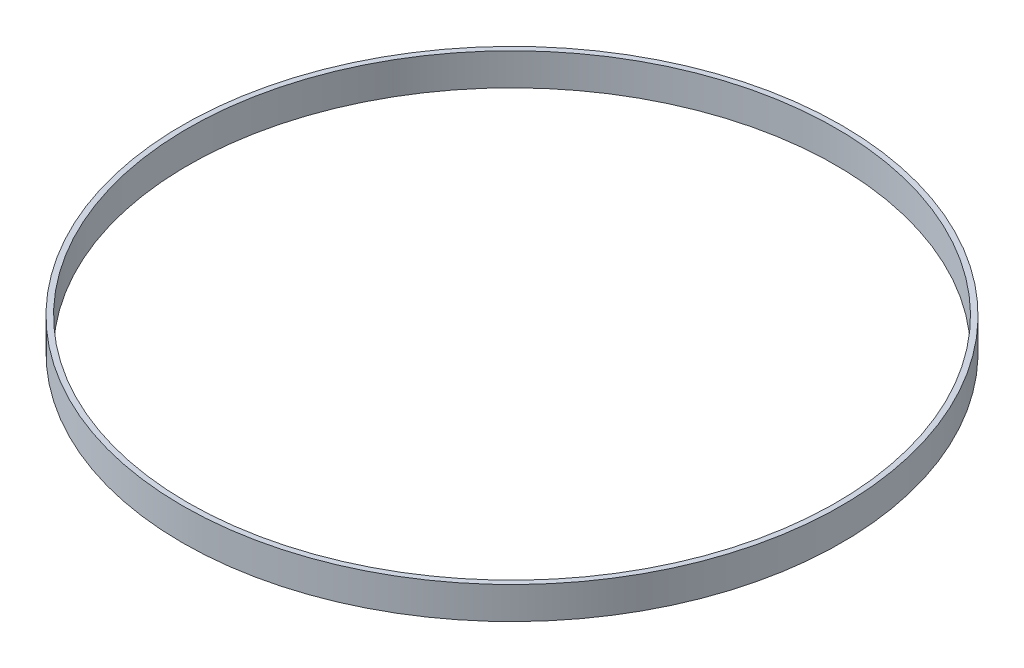
ISO-10303-21;
HEADER;
FILE_DESCRIPTION(('STEP AP214'),'2;1');
FILE_NAME('part.step','',(''),(''),'','','');
FILE_SCHEMA(('AUTOMOTIVE_DESIGN { 1 0 10303 214 1 1 1 1 }'));
ENDSEC;
DATA;
#1=APPLICATION_CONTEXT('core data for automotive mechanical design processes');
#2=APPLICATION_PROTOCOL_DEFINITION('international standard','automotive_design',2000,#1);
#3=PRODUCT_CONTEXT('',#1,'mechanical');
#4=PRODUCT('Part','Part','',(#3));
#5=PRODUCT_RELATED_PRODUCT_CATEGORY('part','',(#4));
#6=PRODUCT_DEFINITION_FORMATION('','',#4);
#7=PRODUCT_DEFINITION_CONTEXT('part definition',#1,'design');
#8=PRODUCT_DEFINITION('design','',#6,#7);
#9=PRODUCT_DEFINITION_SHAPE('','',#8);
#10=(LENGTH_UNIT() NAMED_UNIT(*) SI_UNIT(.MILLI.,.METRE.));
#11=(NAMED_UNIT(*) PLANE_ANGLE_UNIT() SI_UNIT($,.RADIAN.));
#12=(NAMED_UNIT(*) SI_UNIT($,.STERADIAN.) SOLID_ANGLE_UNIT());
#13=UNCERTAINTY_MEASURE_WITH_UNIT(LENGTH_MEASURE(1.E-05),#10,'distance_accuracy_value','');
#14=(GEOMETRIC_REPRESENTATION_CONTEXT(3) GLOBAL_UNCERTAINTY_ASSIGNED_CONTEXT((#13)) GLOBAL_UNIT_ASSIGNED_CONTEXT((#10,
#11,#12)) REPRESENTATION_CONTEXT('',''));
#15=CARTESIAN_POINT('',(0.,0.,0.));
#16=DIRECTION('',(0.,0.,1.));
#17=DIRECTION('',(1.,0.,0.));
#18=AXIS2_PLACEMENT_3D('',#15,#16,#17);
#19=CARTESIAN_POINT('',(0.,9.525,0.));
#20=DIRECTION('',(0.,1.,0.));
#21=DIRECTION('',(0.,0.,1.));
#22=AXIS2_PLACEMENT_3D('',#19,#20,#21);
#23=PLANE('',#22);
#24=CARTESIAN_POINT('',(0.,9.525,0.));
#25=DIRECTION('',(0.,1.,0.));
#26=DIRECTION('',(0.,0.,1.));
#27=AXIS2_PLACEMENT_3D('',#24,#25,#26);
#28=CIRCLE('',#27,97.79);
#29=CARTESIAN_POINT('',(0.,9.525,97.79));
#30=VERTEX_POINT('',#29);
#31=EDGE_CURVE('E10',#30,#30,#28,.T.);
#32=ORIENTED_EDGE('',*,*,#31,.T.);
#33=EDGE_LOOP('',(#32));
#34=FACE_BOUND('',#33,.T.);
#35=CARTESIAN_POINT('',(0.,9.525,0.));
#36=DIRECTION('',(0.,1.,0.));
#37=DIRECTION('',(0.,0.,1.));
#38=AXIS2_PLACEMENT_3D('',#35,#36,#37);
#39=CIRCLE('',#38,96.2025);
#40=CARTESIAN_POINT('',(0.,9.525,96.2025));
#41=VERTEX_POINT('',#40);
#42=EDGE_CURVE('E50',#41,#41,#39,.T.);
#43=ORIENTED_EDGE('',*,*,#42,.F.);
#44=EDGE_LOOP('',(#43));
#45=FACE_BOUND('',#44,.T.);
#46=ADVANCED_FACE('F37',(#34,#45),#23,.T.);
#47=CARTESIAN_POINT('',(0.,0.,0.));
#48=DIRECTION('',(0.,1.,0.));
#49=DIRECTION('',(0.,0.,1.));
#50=AXIS2_PLACEMENT_3D('',#47,#48,#49);
#51=PLANE('',#50);
#52=CARTESIAN_POINT('',(0.,0.,0.));
#53=DIRECTION('',(0.,1.,0.));
#54=DIRECTION('',(0.,0.,1.));
#55=AXIS2_PLACEMENT_3D('',#52,#53,#54);
#56=CIRCLE('',#55,97.79);
#57=CARTESIAN_POINT('',(0.,0.,97.79));
#58=VERTEX_POINT('',#57);
#59=EDGE_CURVE('E41',#58,#58,#56,.T.);
#60=ORIENTED_EDGE('',*,*,#59,.F.);
#61=EDGE_LOOP('',(#60));
#62=FACE_BOUND('',#61,.T.);
#63=CARTESIAN_POINT('',(0.,0.,0.));
#64=DIRECTION('',(0.,1.,0.));
#65=DIRECTION('',(0.,0.,1.));
#66=AXIS2_PLACEMENT_3D('',#63,#64,#65);
#67=CIRCLE('',#66,96.2025);
#68=CARTESIAN_POINT('',(0.,0.,96.2025));
#69=VERTEX_POINT('',#68);
#70=EDGE_CURVE('E52',#69,#69,#67,.T.);
#71=ORIENTED_EDGE('',*,*,#70,.T.);
#72=EDGE_LOOP('',(#71));
#73=FACE_BOUND('',#72,.T.);
#74=ADVANCED_FACE('F64',(#62,#73),#51,.F.);
#75=CARTESIAN_POINT('',(0.,9.525,0.));
#76=DIRECTION('',(0.,-1.,0.));
#77=DIRECTION('',(0.,0.,-1.));
#78=AXIS2_PLACEMENT_3D('',#75,#76,#77);
#79=CYLINDRICAL_SURFACE('',#78,97.79);
#80=ORIENTED_EDGE('',*,*,#31,.F.);
#81=EDGE_LOOP('',(#80));
#82=FACE_BOUND('',#81,.T.);
#83=ORIENTED_EDGE('',*,*,#59,.T.);
#84=EDGE_LOOP('',(#83));
#85=FACE_BOUND('',#84,.T.);
#86=ADVANCED_FACE('F39',(#82,#85),#79,.T.);
#87=CARTESIAN_POINT('',(0.,9.525,0.));
#88=DIRECTION('',(0.,-1.,0.));
#89=DIRECTION('',(0.,0.,-1.));
#90=AXIS2_PLACEMENT_3D('',#87,#88,#89);
#91=CYLINDRICAL_SURFACE('',#90,96.2025);
#92=ORIENTED_EDGE('',*,*,#42,.T.);
#93=EDGE_LOOP('',(#92));
#94=FACE_BOUND('',#93,.T.);
#95=ORIENTED_EDGE('',*,*,#70,.F.);
#96=EDGE_LOOP('',(#95));
#97=FACE_BOUND('',#96,.T.);
#98=ADVANCED_FACE('F60',(#94,#97),#91,.F.);
#99=CLOSED_SHELL('',(#46,#74,#86,#98));
#100=MANIFOLD_SOLID_BREP('B2',#99);
#101=ADVANCED_BREP_SHAPE_REPRESENTATION('',(#18,#100),#14);
#102=SHAPE_DEFINITION_REPRESENTATION(#9,#101);
ENDSEC;
END-ISO-10303-21;
